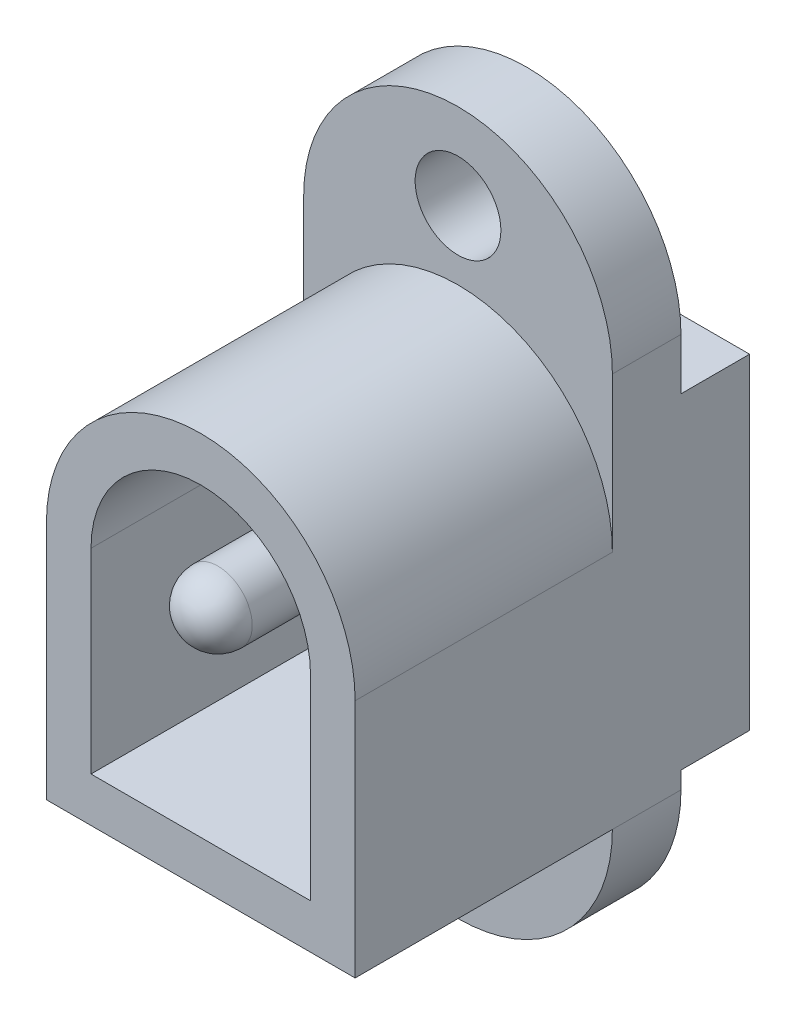
ISO-10303-21;
HEADER;
FILE_DESCRIPTION(('STEP AP214'),'2;1');
FILE_NAME('part.step','',(''),(''),'','','');
FILE_SCHEMA(('AUTOMOTIVE_DESIGN { 1 0 10303 214 1 1 1 1 }'));
ENDSEC;
DATA;
#1=APPLICATION_CONTEXT('core data for automotive mechanical design processes');
#2=APPLICATION_PROTOCOL_DEFINITION('international standard','automotive_design',2000,#1);
#3=PRODUCT_CONTEXT('',#1,'mechanical');
#4=PRODUCT('Part','Part','',(#3));
#5=PRODUCT_RELATED_PRODUCT_CATEGORY('part','',(#4));
#6=PRODUCT_DEFINITION_FORMATION('','',#4);
#7=PRODUCT_DEFINITION_CONTEXT('part definition',#1,'design');
#8=PRODUCT_DEFINITION('design','',#6,#7);
#9=PRODUCT_DEFINITION_SHAPE('','',#8);
#10=(LENGTH_UNIT() NAMED_UNIT(*) SI_UNIT(.MILLI.,.METRE.));
#11=(NAMED_UNIT(*) PLANE_ANGLE_UNIT() SI_UNIT($,.RADIAN.));
#12=(NAMED_UNIT(*) SI_UNIT($,.STERADIAN.) SOLID_ANGLE_UNIT());
#13=UNCERTAINTY_MEASURE_WITH_UNIT(LENGTH_MEASURE(1.E-05),#10,'distance_accuracy_value','');
#14=(GEOMETRIC_REPRESENTATION_CONTEXT(3) GLOBAL_UNCERTAINTY_ASSIGNED_CONTEXT((#13)) GLOBAL_UNIT_ASSIGNED_CONTEXT((#10,
#11,#12)) REPRESENTATION_CONTEXT('',''));
#15=CARTESIAN_POINT('',(0.,0.,0.));
#16=DIRECTION('',(0.,0.,1.));
#17=DIRECTION('',(1.,0.,0.));
#18=AXIS2_PLACEMENT_3D('',#15,#16,#17);
#19=CARTESIAN_POINT('',(0.,0.,0.));
#20=DIRECTION('',(0.,0.,1.));
#21=DIRECTION('',(1.,0.,0.));
#22=AXIS2_PLACEMENT_3D('',#19,#20,#21);
#23=PLANE('',#22);
#24=CARTESIAN_POINT('',(0.,7.75,0.));
#25=DIRECTION('',(0.,0.,1.));
#26=DIRECTION('',(1.,0.,0.));
#27=AXIS2_PLACEMENT_3D('',#24,#25,#26);
#28=CIRCLE('',#27,1.25);
#29=CARTESIAN_POINT('',(1.25,7.75,0.));
#30=VERTEX_POINT('',#29);
#31=EDGE_CURVE('E288',#30,#30,#28,.T.);
#32=ORIENTED_EDGE('',*,*,#31,.T.);
#33=EDGE_LOOP('',(#32));
#34=FACE_BOUND('',#33,.T.);
#35=DIRECTION('',(1.,0.,0.));
#36=VECTOR('',#35,1.);
#37=CARTESIAN_POINT('',(4.5,4.25,0.));
#38=LINE('',#37,#36);
#39=CARTESIAN_POINT('',(-4.5,4.25,0.));
#40=VERTEX_POINT('',#39);
#41=CARTESIAN_POINT('',(4.5,4.25,0.));
#42=VERTEX_POINT('',#41);
#43=EDGE_CURVE('E53',#40,#42,#38,.T.);
#44=ORIENTED_EDGE('',*,*,#43,.F.);
#45=DIRECTION('',(0.,-1.,0.));
#46=VECTOR('',#45,1.);
#47=CARTESIAN_POINT('',(-4.5,-5.75,0.));
#48=LINE('',#47,#46);
#49=CARTESIAN_POINT('',(-4.5,5.75,0.));
#50=VERTEX_POINT('',#49);
#51=EDGE_CURVE('E320',#50,#40,#48,.T.);
#52=ORIENTED_EDGE('',*,*,#51,.F.);
#53=CARTESIAN_POINT('',(0.,5.75,0.));
#54=DIRECTION('',(0.,0.,1.));
#55=DIRECTION('',(1.,0.,0.));
#56=AXIS2_PLACEMENT_3D('',#53,#54,#55);
#57=CIRCLE('',#56,4.5);
#58=CARTESIAN_POINT('',(4.5,5.75,0.));
#59=VERTEX_POINT('',#58);
#60=EDGE_CURVE('E277',#59,#50,#57,.T.);
#61=ORIENTED_EDGE('',*,*,#60,.F.);
#62=DIRECTION('',(0.,1.,0.));
#63=VECTOR('',#62,1.);
#64=CARTESIAN_POINT('',(4.5,-5.75000000000001,0.));
#65=LINE('',#64,#63);
#66=EDGE_CURVE('E58',#42,#59,#65,.T.);
#67=ORIENTED_EDGE('',*,*,#66,.F.);
#68=EDGE_LOOP('',(#44,#52,#61,#67));
#69=FACE_BOUND('',#68,.T.);
#70=ADVANCED_FACE('F36',(#34,#69),#23,.F.);
#71=CARTESIAN_POINT('',(0.,-7.75,0.));
#72=DIRECTION('',(0.,0.,1.));
#73=DIRECTION('',(1.,0.,0.));
#74=AXIS2_PLACEMENT_3D('',#71,#72,#73);
#75=CIRCLE('',#74,1.25);
#76=CARTESIAN_POINT('',(1.25,-7.75,0.));
#77=VERTEX_POINT('',#76);
#78=EDGE_CURVE('E283',#77,#77,#75,.T.);
#79=ORIENTED_EDGE('',*,*,#78,.T.);
#80=EDGE_LOOP('',(#79));
#81=FACE_BOUND('',#80,.T.);
#82=DIRECTION('',(-1.,0.,0.));
#83=VECTOR('',#82,1.);
#84=CARTESIAN_POINT('',(4.5,-5.25,0.));
#85=LINE('',#84,#83);
#86=CARTESIAN_POINT('',(4.5,-5.25,0.));
#87=VERTEX_POINT('',#86);
#88=CARTESIAN_POINT('',(-4.5,-5.25,0.));
#89=VERTEX_POINT('',#88);
#90=EDGE_CURVE('E184',#87,#89,#85,.T.);
#91=ORIENTED_EDGE('',*,*,#90,.F.);
#92=CARTESIAN_POINT('',(4.5,-5.75000000000001,0.));
#93=VERTEX_POINT('',#92);
#94=EDGE_CURVE('E169',#93,#87,#65,.T.);
#95=ORIENTED_EDGE('',*,*,#94,.F.);
#96=CARTESIAN_POINT('',(0.,-5.75,0.));
#97=DIRECTION('',(0.,0.,1.));
#98=DIRECTION('',(1.,0.,0.));
#99=AXIS2_PLACEMENT_3D('',#96,#97,#98);
#100=CIRCLE('',#99,4.5);
#101=CARTESIAN_POINT('',(-4.5,-5.75,0.));
#102=VERTEX_POINT('',#101);
#103=EDGE_CURVE('E278',#102,#93,#100,.T.);
#104=ORIENTED_EDGE('',*,*,#103,.F.);
#105=EDGE_CURVE('E280',#89,#102,#48,.T.);
#106=ORIENTED_EDGE('',*,*,#105,.F.);
#107=EDGE_LOOP('',(#91,#95,#104,#106));
#108=FACE_BOUND('',#107,.T.);
#109=ADVANCED_FACE('F323',(#81,#108),#23,.F.);
#110=CARTESIAN_POINT('',(0.,0.,2.));
#111=DIRECTION('',(0.,0.,1.));
#112=DIRECTION('',(1.,0.,0.));
#113=AXIS2_PLACEMENT_3D('',#110,#111,#112);
#114=PLANE('',#113);
#115=DIRECTION('',(0.,-1.,0.));
#116=VECTOR('',#115,1.);
#117=CARTESIAN_POINT('',(3.2,0.,2.));
#118=LINE('',#117,#116);
#119=CARTESIAN_POINT('',(3.2,1.25,2.));
#120=VERTEX_POINT('',#119);
#121=CARTESIAN_POINT('',(3.2,-4.45,2.));
#122=VERTEX_POINT('',#121);
#123=EDGE_CURVE('E192',#120,#122,#118,.T.);
#124=ORIENTED_EDGE('',*,*,#123,.F.);
#125=CARTESIAN_POINT('',(0.,1.25,2.));
#126=DIRECTION('',(0.,0.,1.));
#127=DIRECTION('',(1.,0.,0.));
#128=AXIS2_PLACEMENT_3D('',#125,#126,#127);
#129=CIRCLE('',#128,3.2);
#130=CARTESIAN_POINT('',(-3.2,1.25,2.));
#131=VERTEX_POINT('',#130);
#132=EDGE_CURVE('E194',#120,#131,#129,.T.);
#133=ORIENTED_EDGE('',*,*,#132,.T.);
#134=DIRECTION('',(0.,-1.,0.));
#135=VECTOR('',#134,1.);
#136=CARTESIAN_POINT('',(-3.2,0.,2.));
#137=LINE('',#136,#135);
#138=CARTESIAN_POINT('',(-3.2,-4.45,2.));
#139=VERTEX_POINT('',#138);
#140=EDGE_CURVE('E198',#131,#139,#137,.T.);
#141=ORIENTED_EDGE('',*,*,#140,.T.);
#142=DIRECTION('',(1.,0.,0.));
#143=VECTOR('',#142,1.);
#144=CARTESIAN_POINT('',(0.,-4.45,2.));
#145=LINE('',#144,#143);
#146=EDGE_CURVE('E201',#139,#122,#145,.T.);
#147=ORIENTED_EDGE('',*,*,#146,.T.);
#148=EDGE_LOOP('',(#124,#133,#141,#147));
#149=FACE_BOUND('',#148,.T.);
#150=CARTESIAN_POINT('',(0.,1.15,2.));
#151=DIRECTION('',(0.,0.,1.));
#152=DIRECTION('',(1.,0.,0.));
#153=AXIS2_PLACEMENT_3D('',#150,#151,#152);
#154=CIRCLE('',#153,1.);
#155=CARTESIAN_POINT('',(1.,1.15,2.));
#156=VERTEX_POINT('',#155);
#157=EDGE_CURVE('E170',#156,#156,#154,.T.);
#158=ORIENTED_EDGE('',*,*,#157,.F.);
#159=EDGE_LOOP('',(#158));
#160=FACE_BOUND('',#159,.T.);
#161=ADVANCED_FACE('F325',(#149,#160),#114,.T.);
#162=CARTESIAN_POINT('',(0.,0.,9.5));
#163=DIRECTION('',(0.,0.,1.));
#164=DIRECTION('',(1.,0.,0.));
#165=AXIS2_PLACEMENT_3D('',#162,#163,#164);
#166=PLANE('',#165);
#167=CARTESIAN_POINT('',(0.,1.25,9.5));
#168=DIRECTION('',(0.,0.,1.));
#169=DIRECTION('',(1.,0.,0.));
#170=AXIS2_PLACEMENT_3D('',#167,#168,#169);
#171=CIRCLE('',#170,4.5);
#172=CARTESIAN_POINT('',(4.5,1.25,9.5));
#173=VERTEX_POINT('',#172);
#174=CARTESIAN_POINT('',(-4.5,1.25,9.5));
#175=VERTEX_POINT('',#174);
#176=EDGE_CURVE('E224',#173,#175,#171,.T.);
#177=ORIENTED_EDGE('',*,*,#176,.T.);
#178=DIRECTION('',(0.,-1.,0.));
#179=VECTOR('',#178,1.);
#180=CARTESIAN_POINT('',(-4.5,0.,9.5));
#181=LINE('',#180,#179);
#182=CARTESIAN_POINT('',(-4.5,-5.75,9.5));
#183=VERTEX_POINT('',#182);
#184=EDGE_CURVE('E227',#175,#183,#181,.T.);
#185=ORIENTED_EDGE('',*,*,#184,.T.);
#186=DIRECTION('',(1.,0.,0.));
#187=VECTOR('',#186,1.);
#188=CARTESIAN_POINT('',(0.,-5.75,9.5));
#189=LINE('',#188,#187);
#190=CARTESIAN_POINT('',(4.5,-5.75000000000001,9.5));
#191=VERTEX_POINT('',#190);
#192=EDGE_CURVE('E230',#183,#191,#189,.T.);
#193=ORIENTED_EDGE('',*,*,#192,.T.);
#194=DIRECTION('',(0.,1.,0.));
#195=VECTOR('',#194,1.);
#196=CARTESIAN_POINT('',(4.5,0.,9.5));
#197=LINE('',#196,#195);
#198=EDGE_CURVE('E232',#191,#173,#197,.T.);
#199=ORIENTED_EDGE('',*,*,#198,.T.);
#200=EDGE_LOOP('',(#177,#185,#193,#199));
#201=FACE_BOUND('',#200,.T.);
#202=CARTESIAN_POINT('',(0.,1.25,9.5));
#203=DIRECTION('',(0.,0.,1.));
#204=DIRECTION('',(1.,0.,0.));
#205=AXIS2_PLACEMENT_3D('',#202,#203,#204);
#206=CIRCLE('',#205,3.2);
#207=CARTESIAN_POINT('',(3.2,1.25,9.5));
#208=VERTEX_POINT('',#207);
#209=CARTESIAN_POINT('',(-3.2,1.25,9.5));
#210=VERTEX_POINT('',#209);
#211=EDGE_CURVE('E207',#208,#210,#206,.T.);
#212=ORIENTED_EDGE('',*,*,#211,.F.);
#213=DIRECTION('',(0.,-1.,0.));
#214=VECTOR('',#213,1.);
#215=CARTESIAN_POINT('',(3.2,0.,9.5));
#216=LINE('',#215,#214);
#217=CARTESIAN_POINT('',(3.2,-4.45,9.5));
#218=VERTEX_POINT('',#217);
#219=EDGE_CURVE('E173',#208,#218,#216,.T.);
#220=ORIENTED_EDGE('',*,*,#219,.T.);
#221=DIRECTION('',(1.,0.,0.));
#222=VECTOR('',#221,1.);
#223=CARTESIAN_POINT('',(0.,-4.45,9.5));
#224=LINE('',#223,#222);
#225=CARTESIAN_POINT('',(-3.2,-4.45,9.5));
#226=VERTEX_POINT('',#225);
#227=EDGE_CURVE('E195',#226,#218,#224,.T.);
#228=ORIENTED_EDGE('',*,*,#227,.F.);
#229=DIRECTION('',(0.,-1.,0.));
#230=VECTOR('',#229,1.);
#231=CARTESIAN_POINT('',(-3.2,0.,9.5));
#232=LINE('',#231,#230);
#233=EDGE_CURVE('E210',#210,#226,#232,.T.);
#234=ORIENTED_EDGE('',*,*,#233,.F.);
#235=EDGE_LOOP('',(#212,#220,#228,#234));
#236=FACE_BOUND('',#235,.T.);
#237=ADVANCED_FACE('F333',(#201,#236),#166,.T.);
#238=CARTESIAN_POINT('',(0.,0.,2.));
#239=DIRECTION('',(0.,0.,1.));
#240=DIRECTION('',(1.,0.,0.));
#241=AXIS2_PLACEMENT_3D('',#238,#239,#240);
#242=PLANE('',#241);
#243=CARTESIAN_POINT('',(0.,1.25,2.));
#244=DIRECTION('',(0.,0.,1.));
#245=DIRECTION('',(1.,0.,0.));
#246=AXIS2_PLACEMENT_3D('',#243,#244,#245);
#247=CIRCLE('',#246,4.5);
#248=CARTESIAN_POINT('',(4.5,1.25,2.));
#249=VERTEX_POINT('',#248);
#250=CARTESIAN_POINT('',(-4.5,1.25,2.));
#251=VERTEX_POINT('',#250);
#252=EDGE_CURVE('E217',#249,#251,#247,.T.);
#253=ORIENTED_EDGE('',*,*,#252,.F.);
#254=DIRECTION('',(0.,1.,0.));
#255=VECTOR('',#254,1.);
#256=CARTESIAN_POINT('',(4.5,-5.75000000000001,2.));
#257=LINE('',#256,#255);
#258=CARTESIAN_POINT('',(4.5,5.75,2.));
#259=VERTEX_POINT('',#258);
#260=EDGE_CURVE('E263',#249,#259,#257,.T.);
#261=ORIENTED_EDGE('',*,*,#260,.T.);
#262=CARTESIAN_POINT('',(0.,5.75,2.));
#263=DIRECTION('',(0.,0.,1.));
#264=DIRECTION('',(1.,0.,0.));
#265=AXIS2_PLACEMENT_3D('',#262,#263,#264);
#266=CIRCLE('',#265,4.5);
#267=CARTESIAN_POINT('',(-4.5,5.75,2.));
#268=VERTEX_POINT('',#267);
#269=EDGE_CURVE('E274',#259,#268,#266,.T.);
#270=ORIENTED_EDGE('',*,*,#269,.T.);
#271=DIRECTION('',(0.,-1.,0.));
#272=VECTOR('',#271,1.);
#273=CARTESIAN_POINT('',(-4.5,-5.75,2.));
#274=LINE('',#273,#272);
#275=EDGE_CURVE('E251',#268,#251,#274,.T.);
#276=ORIENTED_EDGE('',*,*,#275,.T.);
#277=EDGE_LOOP('',(#253,#261,#270,#276));
#278=FACE_BOUND('',#277,.T.);
#279=CARTESIAN_POINT('',(0.,7.75,2.));
#280=DIRECTION('',(0.,0.,1.));
#281=DIRECTION('',(1.,0.,0.));
#282=AXIS2_PLACEMENT_3D('',#279,#280,#281);
#283=CIRCLE('',#282,1.25);
#284=CARTESIAN_POINT('',(1.25,7.75,2.));
#285=VERTEX_POINT('',#284);
#286=EDGE_CURVE('E291',#285,#285,#283,.T.);
#287=ORIENTED_EDGE('',*,*,#286,.F.);
#288=EDGE_LOOP('',(#287));
#289=FACE_BOUND('',#288,.T.);
#290=ADVANCED_FACE('F342',(#278,#289),#242,.T.);
#291=CARTESIAN_POINT('',(-4.5,-5.75,2.));
#292=DIRECTION('',(1.,0.,0.));
#293=DIRECTION('',(0.,0.,-1.));
#294=AXIS2_PLACEMENT_3D('',#291,#292,#293);
#295=PLANE('',#294);
#296=ORIENTED_EDGE('',*,*,#51,.T.);
#297=DIRECTION('',(0.,0.,1.));
#298=VECTOR('',#297,1.);
#299=CARTESIAN_POINT('',(-4.5,4.25,-2.));
#300=LINE('',#299,#298);
#301=CARTESIAN_POINT('',(-4.5,4.25,-2.));
#302=VERTEX_POINT('',#301);
#303=EDGE_CURVE('E175',#302,#40,#300,.T.);
#304=ORIENTED_EDGE('',*,*,#303,.F.);
#305=DIRECTION('',(0.,1.,0.));
#306=VECTOR('',#305,1.);
#307=CARTESIAN_POINT('',(-4.5,-5.25,-2.));
#308=LINE('',#307,#306);
#309=CARTESIAN_POINT('',(-4.5,-5.25,-2.));
#310=VERTEX_POINT('',#309);
#311=EDGE_CURVE('E154',#310,#302,#308,.T.);
#312=ORIENTED_EDGE('',*,*,#311,.F.);
#313=DIRECTION('',(0.,0.,1.));
#314=VECTOR('',#313,1.);
#315=CARTESIAN_POINT('',(-4.5,-5.25,-2.));
#316=LINE('',#315,#314);
#317=EDGE_CURVE('E151',#310,#89,#316,.T.);
#318=ORIENTED_EDGE('',*,*,#317,.T.);
#319=ORIENTED_EDGE('',*,*,#105,.T.);
#320=DIRECTION('',(0.,0.,-1.));
#321=VECTOR('',#320,1.);
#322=CARTESIAN_POINT('',(-4.5,-5.75,2.));
#323=LINE('',#322,#321);
#324=CARTESIAN_POINT('',(-4.5,-5.75,2.));
#325=VERTEX_POINT('',#324);
#326=EDGE_CURVE('E45',#325,#102,#323,.T.);
#327=ORIENTED_EDGE('',*,*,#326,.F.);
#328=DIRECTION('',(0.,0.,-1.));
#329=VECTOR('',#328,1.);
#330=CARTESIAN_POINT('',(-4.5,-5.75,9.5));
#331=LINE('',#330,#329);
#332=EDGE_CURVE('E297',#183,#325,#331,.T.);
#333=ORIENTED_EDGE('',*,*,#332,.F.);
#334=ORIENTED_EDGE('',*,*,#184,.F.);
#335=DIRECTION('',(0.,0.,-1.));
#336=VECTOR('',#335,1.);
#337=CARTESIAN_POINT('',(-4.5,1.25,9.5));
#338=LINE('',#337,#336);
#339=EDGE_CURVE('E294',#175,#251,#338,.T.);
#340=ORIENTED_EDGE('',*,*,#339,.T.);
#341=ORIENTED_EDGE('',*,*,#275,.F.);
#342=DIRECTION('',(0.,0.,-1.));
#343=VECTOR('',#342,1.);
#344=CARTESIAN_POINT('',(-4.5,5.75,2.));
#345=LINE('',#344,#343);
#346=EDGE_CURVE('E258',#268,#50,#345,.T.);
#347=ORIENTED_EDGE('',*,*,#346,.T.);
#348=EDGE_LOOP('',(#296,#304,#312,#318,#319,#327,#333,#334,#340,#341,#347));
#349=FACE_BOUND('',#348,.T.);
#350=ADVANCED_FACE('F318',(#349),#295,.F.);
#351=CARTESIAN_POINT('',(4.5,-5.75000000000001,2.));
#352=DIRECTION('',(-1.,0.,0.));
#353=DIRECTION('',(0.,0.,1.));
#354=AXIS2_PLACEMENT_3D('',#351,#352,#353);
#355=PLANE('',#354);
#356=ORIENTED_EDGE('',*,*,#94,.T.);
#357=DIRECTION('',(0.,0.,1.));
#358=VECTOR('',#357,1.);
#359=CARTESIAN_POINT('',(4.5,-5.25,-2.));
#360=LINE('',#359,#358);
#361=CARTESIAN_POINT('',(4.5,-5.25,-2.));
#362=VERTEX_POINT('',#361);
#363=EDGE_CURVE('E149',#362,#87,#360,.T.);
#364=ORIENTED_EDGE('',*,*,#363,.F.);
#365=DIRECTION('',(0.,-1.,0.));
#366=VECTOR('',#365,1.);
#367=CARTESIAN_POINT('',(4.5,-5.25,-2.));
#368=LINE('',#367,#366);
#369=CARTESIAN_POINT('',(4.5,4.25,-2.));
#370=VERTEX_POINT('',#369);
#371=EDGE_CURVE('E155',#370,#362,#368,.T.);
#372=ORIENTED_EDGE('',*,*,#371,.F.);
#373=DIRECTION('',(0.,0.,1.));
#374=VECTOR('',#373,1.);
#375=CARTESIAN_POINT('',(4.5,4.25,-2.));
#376=LINE('',#375,#374);
#377=EDGE_CURVE('E185',#370,#42,#376,.T.);
#378=ORIENTED_EDGE('',*,*,#377,.T.);
#379=ORIENTED_EDGE('',*,*,#66,.T.);
#380=DIRECTION('',(0.,0.,-1.));
#381=VECTOR('',#380,1.);
#382=CARTESIAN_POINT('',(4.5,5.75,2.));
#383=LINE('',#382,#381);
#384=EDGE_CURVE('E262',#259,#59,#383,.T.);
#385=ORIENTED_EDGE('',*,*,#384,.F.);
#386=ORIENTED_EDGE('',*,*,#260,.F.);
#387=DIRECTION('',(0.,0.,-1.));
#388=VECTOR('',#387,1.);
#389=CARTESIAN_POINT('',(4.5,1.25,9.5));
#390=LINE('',#389,#388);
#391=EDGE_CURVE('E234',#173,#249,#390,.T.);
#392=ORIENTED_EDGE('',*,*,#391,.F.);
#393=ORIENTED_EDGE('',*,*,#198,.F.);
#394=DIRECTION('',(0.,0.,-1.));
#395=VECTOR('',#394,1.);
#396=CARTESIAN_POINT('',(4.5,-5.75000000000001,9.5));
#397=LINE('',#396,#395);
#398=CARTESIAN_POINT('',(4.5,-5.75000000000001,2.));
#399=VERTEX_POINT('',#398);
#400=EDGE_CURVE('E246',#191,#399,#397,.T.);
#401=ORIENTED_EDGE('',*,*,#400,.T.);
#402=DIRECTION('',(0.,0.,-1.));
#403=VECTOR('',#402,1.);
#404=CARTESIAN_POINT('',(4.5,-5.75000000000001,2.));
#405=LINE('',#404,#403);
#406=EDGE_CURVE('E266',#399,#93,#405,.T.);
#407=ORIENTED_EDGE('',*,*,#406,.T.);
#408=EDGE_LOOP('',(#356,#364,#372,#378,#379,#385,#386,#392,#393,#401,#407));
#409=FACE_BOUND('',#408,.T.);
#410=ADVANCED_FACE('F166',(#409),#355,.F.);
#411=DIRECTION('',(1.,0.,0.));
#412=VECTOR('',#411,1.);
#413=CARTESIAN_POINT('',(0.,-5.75,2.));
#414=LINE('',#413,#412);
#415=EDGE_CURVE('E228',#325,#399,#414,.T.);
#416=ORIENTED_EDGE('',*,*,#415,.F.);
#417=CARTESIAN_POINT('',(0.,-5.75,2.));
#418=DIRECTION('',(0.,0.,1.));
#419=DIRECTION('',(1.,0.,0.));
#420=AXIS2_PLACEMENT_3D('',#417,#418,#419);
#421=CIRCLE('',#420,4.5);
#422=EDGE_CURVE('E281',#325,#399,#421,.T.);
#423=ORIENTED_EDGE('',*,*,#422,.T.);
#424=EDGE_LOOP('',(#416,#423));
#425=FACE_BOUND('',#424,.T.);
#426=CARTESIAN_POINT('',(0.,-7.75,2.));
#427=DIRECTION('',(0.,0.,1.));
#428=DIRECTION('',(1.,0.,0.));
#429=AXIS2_PLACEMENT_3D('',#426,#427,#428);
#430=CIRCLE('',#429,1.25);
#431=CARTESIAN_POINT('',(1.25,-7.75,2.));
#432=VERTEX_POINT('',#431);
#433=EDGE_CURVE('E285',#432,#432,#430,.T.);
#434=ORIENTED_EDGE('',*,*,#433,.F.);
#435=EDGE_LOOP('',(#434));
#436=FACE_BOUND('',#435,.T.);
#437=ADVANCED_FACE('F311',(#425,#436),#242,.T.);
#438=CARTESIAN_POINT('',(0.,5.75,0.));
#439=DIRECTION('',(0.,0.,1.));
#440=DIRECTION('',(1.,0.,0.));
#441=AXIS2_PLACEMENT_3D('',#438,#439,#440);
#442=CYLINDRICAL_SURFACE('',#441,4.5);
#443=ORIENTED_EDGE('',*,*,#384,.T.);
#444=ORIENTED_EDGE('',*,*,#60,.T.);
#445=ORIENTED_EDGE('',*,*,#346,.F.);
#446=ORIENTED_EDGE('',*,*,#269,.F.);
#447=EDGE_LOOP('',(#443,#444,#445,#446));
#448=FACE_BOUND('',#447,.T.);
#449=ADVANCED_FACE('F354',(#448),#442,.T.);
#450=CARTESIAN_POINT('',(0.,-5.75,0.));
#451=DIRECTION('',(0.,0.,1.));
#452=DIRECTION('',(1.,0.,0.));
#453=AXIS2_PLACEMENT_3D('',#450,#451,#452);
#454=CYLINDRICAL_SURFACE('',#453,4.5);
#455=ORIENTED_EDGE('',*,*,#326,.T.);
#456=ORIENTED_EDGE('',*,*,#103,.T.);
#457=ORIENTED_EDGE('',*,*,#406,.F.);
#458=ORIENTED_EDGE('',*,*,#422,.F.);
#459=EDGE_LOOP('',(#455,#456,#457,#458));
#460=FACE_BOUND('',#459,.T.);
#461=ADVANCED_FACE('F315',(#460),#454,.T.);
#462=CARTESIAN_POINT('',(0.,-7.75,0.));
#463=DIRECTION('',(0.,0.,1.));
#464=DIRECTION('',(1.,0.,0.));
#465=AXIS2_PLACEMENT_3D('',#462,#463,#464);
#466=CYLINDRICAL_SURFACE('',#465,1.25);
#467=ORIENTED_EDGE('',*,*,#78,.F.);
#468=EDGE_LOOP('',(#467));
#469=FACE_BOUND('',#468,.T.);
#470=ORIENTED_EDGE('',*,*,#433,.T.);
#471=EDGE_LOOP('',(#470));
#472=FACE_BOUND('',#471,.T.);
#473=ADVANCED_FACE('F362',(#469,#472),#466,.F.);
#474=CARTESIAN_POINT('',(0.,7.75,0.));
#475=DIRECTION('',(0.,0.,1.));
#476=DIRECTION('',(1.,0.,0.));
#477=AXIS2_PLACEMENT_3D('',#474,#475,#476);
#478=CYLINDRICAL_SURFACE('',#477,1.25);
#479=ORIENTED_EDGE('',*,*,#31,.F.);
#480=EDGE_LOOP('',(#479));
#481=FACE_BOUND('',#480,.T.);
#482=ORIENTED_EDGE('',*,*,#286,.T.);
#483=EDGE_LOOP('',(#482));
#484=FACE_BOUND('',#483,.T.);
#485=ADVANCED_FACE('F367',(#481,#484),#478,.F.);
#486=CARTESIAN_POINT('',(0.,1.25,9.5));
#487=DIRECTION('',(0.,0.,-1.));
#488=DIRECTION('',(-1.,0.,0.));
#489=AXIS2_PLACEMENT_3D('',#486,#487,#488);
#490=CYLINDRICAL_SURFACE('',#489,4.5);
#491=ORIENTED_EDGE('',*,*,#252,.T.);
#492=ORIENTED_EDGE('',*,*,#339,.F.);
#493=ORIENTED_EDGE('',*,*,#176,.F.);
#494=ORIENTED_EDGE('',*,*,#391,.T.);
#495=EDGE_LOOP('',(#491,#492,#493,#494));
#496=FACE_BOUND('',#495,.T.);
#497=ADVANCED_FACE('F371',(#496),#490,.T.);
#498=CARTESIAN_POINT('',(0.,-5.75,9.5));
#499=DIRECTION('',(0.,1.,0.));
#500=DIRECTION('',(-1.,0.,0.));
#501=AXIS2_PLACEMENT_3D('',#498,#499,#500);
#502=PLANE('',#501);
#503=ORIENTED_EDGE('',*,*,#415,.T.);
#504=ORIENTED_EDGE('',*,*,#400,.F.);
#505=ORIENTED_EDGE('',*,*,#192,.F.);
#506=ORIENTED_EDGE('',*,*,#332,.T.);
#507=EDGE_LOOP('',(#503,#504,#505,#506));
#508=FACE_BOUND('',#507,.T.);
#509=ADVANCED_FACE('F307',(#508),#502,.F.);
#510=CARTESIAN_POINT('',(3.2,0.,2.));
#511=DIRECTION('',(-1.,0.,0.));
#512=DIRECTION('',(0.,-1.,0.));
#513=AXIS2_PLACEMENT_3D('',#510,#511,#512);
#514=PLANE('',#513);
#515=ORIENTED_EDGE('',*,*,#219,.F.);
#516=DIRECTION('',(0.,0.,1.));
#517=VECTOR('',#516,1.);
#518=CARTESIAN_POINT('',(3.2,1.25,2.));
#519=LINE('',#518,#517);
#520=EDGE_CURVE('E204',#120,#208,#519,.T.);
#521=ORIENTED_EDGE('',*,*,#520,.F.);
#522=ORIENTED_EDGE('',*,*,#123,.T.);
#523=DIRECTION('',(0.,0.,1.));
#524=VECTOR('',#523,1.);
#525=CARTESIAN_POINT('',(3.2,-4.45,2.));
#526=LINE('',#525,#524);
#527=EDGE_CURVE('E215',#122,#218,#526,.T.);
#528=ORIENTED_EDGE('',*,*,#527,.T.);
#529=EDGE_LOOP('',(#515,#521,#522,#528));
#530=FACE_BOUND('',#529,.T.);
#531=ADVANCED_FACE('F377',(#530),#514,.T.);
#532=CARTESIAN_POINT('',(0.,-4.45,2.));
#533=DIRECTION('',(0.,-1.,0.));
#534=DIRECTION('',(0.,0.,-1.));
#535=AXIS2_PLACEMENT_3D('',#532,#533,#534);
#536=PLANE('',#535);
#537=ORIENTED_EDGE('',*,*,#227,.T.);
#538=ORIENTED_EDGE('',*,*,#527,.F.);
#539=ORIENTED_EDGE('',*,*,#146,.F.);
#540=DIRECTION('',(0.,0.,1.));
#541=VECTOR('',#540,1.);
#542=CARTESIAN_POINT('',(-3.2,-4.45,2.));
#543=LINE('',#542,#541);
#544=EDGE_CURVE('E218',#139,#226,#543,.T.);
#545=ORIENTED_EDGE('',*,*,#544,.T.);
#546=EDGE_LOOP('',(#537,#538,#539,#545));
#547=FACE_BOUND('',#546,.T.);
#548=ADVANCED_FACE('F381',(#547),#536,.F.);
#549=CARTESIAN_POINT('',(-3.2,0.,2.));
#550=DIRECTION('',(-1.,0.,0.));
#551=DIRECTION('',(0.,-1.,0.));
#552=AXIS2_PLACEMENT_3D('',#549,#550,#551);
#553=PLANE('',#552);
#554=ORIENTED_EDGE('',*,*,#233,.T.);
#555=ORIENTED_EDGE('',*,*,#544,.F.);
#556=ORIENTED_EDGE('',*,*,#140,.F.);
#557=DIRECTION('',(0.,0.,1.));
#558=VECTOR('',#557,1.);
#559=CARTESIAN_POINT('',(-3.2,1.25,2.));
#560=LINE('',#559,#558);
#561=EDGE_CURVE('E220',#131,#210,#560,.T.);
#562=ORIENTED_EDGE('',*,*,#561,.T.);
#563=EDGE_LOOP('',(#554,#555,#556,#562));
#564=FACE_BOUND('',#563,.T.);
#565=ADVANCED_FACE('F387',(#564),#553,.F.);
#566=CARTESIAN_POINT('',(0.,1.25,2.));
#567=DIRECTION('',(0.,0.,1.));
#568=DIRECTION('',(1.,0.,0.));
#569=AXIS2_PLACEMENT_3D('',#566,#567,#568);
#570=CYLINDRICAL_SURFACE('',#569,3.2);
#571=ORIENTED_EDGE('',*,*,#211,.T.);
#572=ORIENTED_EDGE('',*,*,#561,.F.);
#573=ORIENTED_EDGE('',*,*,#132,.F.);
#574=ORIENTED_EDGE('',*,*,#520,.T.);
#575=EDGE_LOOP('',(#571,#572,#573,#574));
#576=FACE_BOUND('',#575,.T.);
#577=ADVANCED_FACE('F383',(#576),#570,.F.);
#578=CARTESIAN_POINT('',(0.,1.15,10.));
#579=DIRECTION('',(0.,0.,-1.));
#580=DIRECTION('',(-1.,0.,0.));
#581=AXIS2_PLACEMENT_3D('',#578,#579,#580);
#582=CYLINDRICAL_SURFACE('',#581,1.);
#583=CARTESIAN_POINT('',(0.,1.15,9.));
#584=DIRECTION('',(0.,0.,-1.));
#585=DIRECTION('',(-1.,0.,0.));
#586=AXIS2_PLACEMENT_3D('',#583,#584,#585);
#587=CIRCLE('',#586,1.);
#588=CARTESIAN_POINT('',(-1.,1.15,9.));
#589=VERTEX_POINT('',#588);
#590=EDGE_CURVE('E11',#589,#589,#587,.T.);
#591=ORIENTED_EDGE('',*,*,#590,.T.);
#592=EDGE_LOOP('',(#591));
#593=FACE_BOUND('',#592,.T.);
#594=ORIENTED_EDGE('',*,*,#157,.T.);
#595=EDGE_LOOP('',(#594));
#596=FACE_BOUND('',#595,.T.);
#597=ADVANCED_FACE('F386',(#593,#596),#582,.T.);
#598=CARTESIAN_POINT('',(0.,1.15,9.));
#599=DIRECTION('',(0.,0.,1.));
#600=DIRECTION('',(1.,0.,0.));
#601=AXIS2_PLACEMENT_3D('',#598,#599,#600);
#602=SPHERICAL_SURFACE('',#601,1.);
#603=ORIENTED_EDGE('',*,*,#590,.F.);
#604=EDGE_LOOP('',(#603));
#605=FACE_BOUND('',#604,.T.);
#606=ADVANCED_FACE('F38',(#605),#602,.T.);
#607=CARTESIAN_POINT('',(4.5,-5.25,-2.));
#608=DIRECTION('',(0.,1.,0.));
#609=DIRECTION('',(0.,0.,1.));
#610=AXIS2_PLACEMENT_3D('',#607,#608,#609);
#611=PLANE('',#610);
#612=ORIENTED_EDGE('',*,*,#90,.T.);
#613=ORIENTED_EDGE('',*,*,#317,.F.);
#614=DIRECTION('',(-1.,0.,0.));
#615=VECTOR('',#614,1.);
#616=CARTESIAN_POINT('',(4.5,-5.25,-2.));
#617=LINE('',#616,#615);
#618=EDGE_CURVE('E144',#362,#310,#617,.T.);
#619=ORIENTED_EDGE('',*,*,#618,.F.);
#620=ORIENTED_EDGE('',*,*,#363,.T.);
#621=EDGE_LOOP('',(#612,#613,#619,#620));
#622=FACE_BOUND('',#621,.T.);
#623=ADVANCED_FACE('F147',(#622),#611,.F.);
#624=CARTESIAN_POINT('',(4.5,4.25,-2.));
#625=DIRECTION('',(0.,-1.,0.));
#626=DIRECTION('',(1.,0.,0.));
#627=AXIS2_PLACEMENT_3D('',#624,#625,#626);
#628=PLANE('',#627);
#629=ORIENTED_EDGE('',*,*,#43,.T.);
#630=ORIENTED_EDGE('',*,*,#377,.F.);
#631=DIRECTION('',(1.,0.,0.));
#632=VECTOR('',#631,1.);
#633=CARTESIAN_POINT('',(4.5,4.25,-2.));
#634=LINE('',#633,#632);
#635=EDGE_CURVE('E160',#302,#370,#634,.T.);
#636=ORIENTED_EDGE('',*,*,#635,.F.);
#637=ORIENTED_EDGE('',*,*,#303,.T.);
#638=EDGE_LOOP('',(#629,#630,#636,#637));
#639=FACE_BOUND('',#638,.T.);
#640=ADVANCED_FACE('F400',(#639),#628,.F.);
#641=CARTESIAN_POINT('',(0.,0.,-2.));
#642=DIRECTION('',(0.,0.,1.));
#643=DIRECTION('',(1.,0.,0.));
#644=AXIS2_PLACEMENT_3D('',#641,#642,#643);
#645=PLANE('',#644);
#646=ORIENTED_EDGE('',*,*,#371,.T.);
#647=ORIENTED_EDGE('',*,*,#618,.T.);
#648=ORIENTED_EDGE('',*,*,#311,.T.);
#649=ORIENTED_EDGE('',*,*,#635,.T.);
#650=EDGE_LOOP('',(#646,#647,#648,#649));
#651=FACE_BOUND('',#650,.T.);
#652=ADVANCED_FACE('F158',(#651),#645,.F.);
#653=CLOSED_SHELL('',(#70,#109,#161,#237,#290,#350,#410,#437,#449,#461,#473,#485,#497,#509,#531,
#548,#565,#577,#597,#606,#623,#640,#652));
#654=MANIFOLD_SOLID_BREP('B2',#653);
#655=ADVANCED_BREP_SHAPE_REPRESENTATION('',(#18,#654),#14);
#656=SHAPE_DEFINITION_REPRESENTATION(#9,#655);
ENDSEC;
END-ISO-10303-21;
